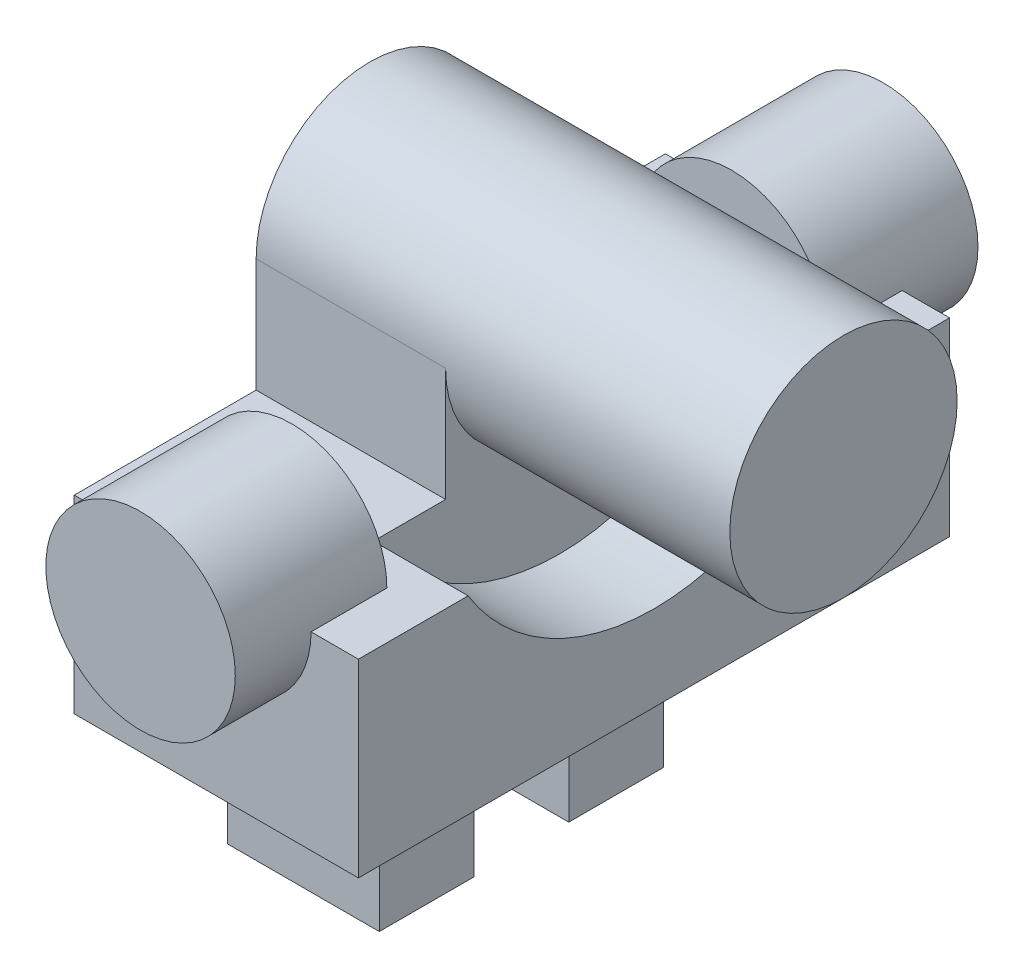
ISO-10303-21;
HEADER;
FILE_DESCRIPTION(('STEP AP214'),'2;1');
FILE_NAME('part.step','',(''),(''),'','','');
FILE_SCHEMA(('AUTOMOTIVE_DESIGN { 1 0 10303 214 1 1 1 1 }'));
ENDSEC;
DATA;
#1=APPLICATION_CONTEXT('core data for automotive mechanical design processes');
#2=APPLICATION_PROTOCOL_DEFINITION('international standard','automotive_design',2000,#1);
#3=PRODUCT_CONTEXT('',#1,'mechanical');
#4=PRODUCT('Part','Part','',(#3));
#5=PRODUCT_RELATED_PRODUCT_CATEGORY('part','',(#4));
#6=PRODUCT_DEFINITION_FORMATION('','',#4);
#7=PRODUCT_DEFINITION_CONTEXT('part definition',#1,'design');
#8=PRODUCT_DEFINITION('design','',#6,#7);
#9=PRODUCT_DEFINITION_SHAPE('','',#8);
#10=(LENGTH_UNIT() NAMED_UNIT(*) SI_UNIT(.MILLI.,.METRE.));
#11=(NAMED_UNIT(*) PLANE_ANGLE_UNIT() SI_UNIT($,.RADIAN.));
#12=(NAMED_UNIT(*) SI_UNIT($,.STERADIAN.) SOLID_ANGLE_UNIT());
#13=UNCERTAINTY_MEASURE_WITH_UNIT(LENGTH_MEASURE(1.E-05),#10,'distance_accuracy_value','');
#14=(GEOMETRIC_REPRESENTATION_CONTEXT(3) GLOBAL_UNCERTAINTY_ASSIGNED_CONTEXT((#13)) GLOBAL_UNIT_ASSIGNED_CONTEXT((#10,
#11,#12)) REPRESENTATION_CONTEXT('',''));
#15=CARTESIAN_POINT('',(0.,0.,0.));
#16=DIRECTION('',(0.,0.,1.));
#17=DIRECTION('',(1.,0.,0.));
#18=AXIS2_PLACEMENT_3D('',#15,#16,#17);
#19=CARTESIAN_POINT('',(2.5,-6.,6.));
#20=DIRECTION('',(0.,1.,0.));
#21=DIRECTION('',(0.,0.,1.));
#22=AXIS2_PLACEMENT_3D('',#19,#20,#21);
#23=PLANE('',#22);
#24=DIRECTION('',(1.,0.,0.));
#25=VECTOR('',#24,1.);
#26=CARTESIAN_POINT('',(2.5,-6.,11.6));
#27=LINE('',#26,#25);
#28=CARTESIAN_POINT('',(-10.,-6.,11.6));
#29=VERTEX_POINT('',#28);
#30=CARTESIAN_POINT('',(0.,-6.,11.6));
#31=VERTEX_POINT('',#30);
#32=EDGE_CURVE('E201',#29,#31,#27,.T.);
#33=ORIENTED_EDGE('',*,*,#32,.T.);
#34=DIRECTION('',(0.,0.,-1.));
#35=VECTOR('',#34,1.);
#36=CARTESIAN_POINT('',(0.,-5.99999999999999,19.6));
#37=LINE('',#36,#35);
#38=CARTESIAN_POINT('',(0.,-6.,15.6));
#39=VERTEX_POINT('',#38);
#40=EDGE_CURVE('E184',#31,#39,#37,.F.);
#41=ORIENTED_EDGE('',*,*,#40,.T.);
#42=DIRECTION('',(-1.,0.,0.));
#43=VECTOR('',#42,1.);
#44=CARTESIAN_POINT('',(2.5,-6.,15.6));
#45=LINE('',#44,#43);
#46=CARTESIAN_POINT('',(2.5,-6.,15.6));
#47=VERTEX_POINT('',#46);
#48=EDGE_CURVE('E219',#47,#39,#45,.T.);
#49=ORIENTED_EDGE('',*,*,#48,.F.);
#50=DIRECTION('',(0.,0.,-1.));
#51=VECTOR('',#50,1.);
#52=CARTESIAN_POINT('',(2.5,-6.,6.));
#53=LINE('',#52,#51);
#54=CARTESIAN_POINT('',(2.5,-6.,9.81070843517429));
#55=VERTEX_POINT('',#54);
#56=EDGE_CURVE('E270',#47,#55,#53,.T.);
#57=ORIENTED_EDGE('',*,*,#56,.T.);
#58=DIRECTION('',(1.,0.,0.));
#59=VECTOR('',#58,1.);
#60=CARTESIAN_POINT('',(-2.5,-6.,9.81070843517429));
#61=LINE('',#60,#59);
#62=CARTESIAN_POINT('',(-2.5,-6.,9.81070843517429));
#63=VERTEX_POINT('',#62);
#64=EDGE_CURVE('E285',#63,#55,#61,.T.);
#65=ORIENTED_EDGE('',*,*,#64,.F.);
#66=DIRECTION('',(0.,0.,-1.));
#67=VECTOR('',#66,1.);
#68=CARTESIAN_POINT('',(-2.5,-6.,6.));
#69=LINE('',#68,#67);
#70=CARTESIAN_POINT('',(-2.5,-6.,6.));
#71=VERTEX_POINT('',#70);
#72=EDGE_CURVE('E204',#63,#71,#69,.T.);
#73=ORIENTED_EDGE('',*,*,#72,.T.);
#74=DIRECTION('',(-1.,0.,0.));
#75=VECTOR('',#74,1.);
#76=CARTESIAN_POINT('',(2.5,-6.,6.));
#77=LINE('',#76,#75);
#78=CARTESIAN_POINT('',(-12.5,-6.,6.));
#79=VERTEX_POINT('',#78);
#80=EDGE_CURVE('E222',#71,#79,#77,.T.);
#81=ORIENTED_EDGE('',*,*,#80,.T.);
#82=DIRECTION('',(0.,0.,-1.));
#83=VECTOR('',#82,1.);
#84=CARTESIAN_POINT('',(-12.5,-6.,6.));
#85=LINE('',#84,#83);
#86=CARTESIAN_POINT('',(-12.5,-6.,15.6));
#87=VERTEX_POINT('',#86);
#88=EDGE_CURVE('E255',#87,#79,#85,.T.);
#89=ORIENTED_EDGE('',*,*,#88,.F.);
#90=CARTESIAN_POINT('',(-10.,-5.99999999999999,15.6));
#91=VERTEX_POINT('',#90);
#92=EDGE_CURVE('E223',#91,#87,#45,.T.);
#93=ORIENTED_EDGE('',*,*,#92,.F.);
#94=DIRECTION('',(0.,0.,-1.));
#95=VECTOR('',#94,1.);
#96=CARTESIAN_POINT('',(-10.,-5.99999999999999,19.6));
#97=LINE('',#96,#95);
#98=EDGE_CURVE('E198',#91,#29,#97,.T.);
#99=ORIENTED_EDGE('',*,*,#98,.T.);
#100=EDGE_LOOP('',(#33,#41,#49,#57,#65,#73,#81,#89,#93,#99));
#101=FACE_BOUND('',#100,.T.);
#102=ADVANCED_FACE('F33',(#101),#23,.T.);
#103=CARTESIAN_POINT('',(2.5,0.,-6.));
#104=DIRECTION('',(0.,0.,-1.));
#105=DIRECTION('',(-1.,0.,0.));
#106=AXIS2_PLACEMENT_3D('',#103,#104,#105);
#107=PLANE('',#106);
#108=DIRECTION('',(-1.,0.,0.));
#109=VECTOR('',#108,1.);
#110=CARTESIAN_POINT('',(2.5,0.,-6.));
#111=LINE('',#110,#109);
#112=CARTESIAN_POINT('',(-2.5,0.,-6.));
#113=VERTEX_POINT('',#112);
#114=CARTESIAN_POINT('',(-12.5,0.,-6.));
#115=VERTEX_POINT('',#114);
#116=EDGE_CURVE('E227',#113,#115,#111,.T.);
#117=ORIENTED_EDGE('',*,*,#116,.F.);
#118=DIRECTION('',(0.,-1.,0.));
#119=VECTOR('',#118,1.);
#120=CARTESIAN_POINT('',(-2.5,0.,-6.));
#121=LINE('',#120,#119);
#122=CARTESIAN_POINT('',(-2.5,-6.,-6.));
#123=VERTEX_POINT('',#122);
#124=EDGE_CURVE('E277',#113,#123,#121,.T.);
#125=ORIENTED_EDGE('',*,*,#124,.T.);
#126=DIRECTION('',(-1.,0.,0.));
#127=VECTOR('',#126,1.);
#128=CARTESIAN_POINT('',(2.5,-6.,-6.));
#129=LINE('',#128,#127);
#130=CARTESIAN_POINT('',(-12.5,-6.,-6.));
#131=VERTEX_POINT('',#130);
#132=EDGE_CURVE('E229',#123,#131,#129,.T.);
#133=ORIENTED_EDGE('',*,*,#132,.T.);
#134=DIRECTION('',(0.,-1.,0.));
#135=VECTOR('',#134,1.);
#136=CARTESIAN_POINT('',(-12.5,0.,-6.));
#137=LINE('',#136,#135);
#138=EDGE_CURVE('E249',#115,#131,#137,.T.);
#139=ORIENTED_EDGE('',*,*,#138,.F.);
#140=EDGE_LOOP('',(#117,#125,#133,#139));
#141=FACE_BOUND('',#140,.T.);
#142=ADVANCED_FACE('F385',(#141),#107,.T.);
#143=CARTESIAN_POINT('',(2.5,0.,6.));
#144=DIRECTION('',(0.,0.,1.));
#145=DIRECTION('',(1.,0.,0.));
#146=AXIS2_PLACEMENT_3D('',#143,#144,#145);
#147=PLANE('',#146);
#148=ORIENTED_EDGE('',*,*,#80,.F.);
#149=DIRECTION('',(0.,1.,0.));
#150=VECTOR('',#149,1.);
#151=CARTESIAN_POINT('',(-2.5,0.,6.));
#152=LINE('',#151,#150);
#153=CARTESIAN_POINT('',(-2.5,0.,6.));
#154=VERTEX_POINT('',#153);
#155=EDGE_CURVE('E280',#71,#154,#152,.T.);
#156=ORIENTED_EDGE('',*,*,#155,.T.);
#157=DIRECTION('',(-1.,0.,0.));
#158=VECTOR('',#157,1.);
#159=CARTESIAN_POINT('',(2.5,0.,6.));
#160=LINE('',#159,#158);
#161=CARTESIAN_POINT('',(-12.5,0.,6.));
#162=VERTEX_POINT('',#161);
#163=EDGE_CURVE('E225',#154,#162,#160,.T.);
#164=ORIENTED_EDGE('',*,*,#163,.T.);
#165=DIRECTION('',(0.,1.,0.));
#166=VECTOR('',#165,1.);
#167=CARTESIAN_POINT('',(-12.5,0.,6.));
#168=LINE('',#167,#166);
#169=EDGE_CURVE('E252',#79,#162,#168,.T.);
#170=ORIENTED_EDGE('',*,*,#169,.F.);
#171=EDGE_LOOP('',(#148,#156,#164,#170));
#172=FACE_BOUND('',#171,.T.);
#173=ADVANCED_FACE('F391',(#172),#147,.T.);
#174=CARTESIAN_POINT('',(12.5,0.,0.));
#175=DIRECTION('',(-1.,0.,0.));
#176=DIRECTION('',(0.,0.,1.));
#177=AXIS2_PLACEMENT_3D('',#174,#175,#176);
#178=CYLINDRICAL_SURFACE('',#177,6.);
#179=CARTESIAN_POINT('',(-2.5,0.,0.));
#180=DIRECTION('',(1.,0.,0.));
#181=DIRECTION('',(0.,0.,-1.));
#182=AXIS2_PLACEMENT_3D('',#179,#180,#181);
#183=CIRCLE('',#182,6.);
#184=EDGE_CURVE('E290',#154,#113,#183,.T.);
#185=ORIENTED_EDGE('',*,*,#184,.T.);
#186=ORIENTED_EDGE('',*,*,#116,.T.);
#187=CARTESIAN_POINT('',(-12.5,0.,0.));
#188=DIRECTION('',(1.,0.,0.));
#189=DIRECTION('',(0.,0.,-1.));
#190=AXIS2_PLACEMENT_3D('',#187,#188,#189);
#191=CIRCLE('',#190,6.);
#192=EDGE_CURVE('E213',#115,#162,#191,.T.);
#193=ORIENTED_EDGE('',*,*,#192,.T.);
#194=ORIENTED_EDGE('',*,*,#163,.F.);
#195=EDGE_LOOP('',(#185,#186,#193,#194));
#196=FACE_BOUND('',#195,.T.);
#197=CARTESIAN_POINT('',(12.5,0.,0.));
#198=DIRECTION('',(1.,0.,0.));
#199=DIRECTION('',(0.,0.,-1.));
#200=AXIS2_PLACEMENT_3D('',#197,#198,#199);
#201=CIRCLE('',#200,6.);
#202=CARTESIAN_POINT('',(12.5,0.,-6.));
#203=VERTEX_POINT('',#202);
#204=EDGE_CURVE('E212',#203,#203,#201,.T.);
#205=ORIENTED_EDGE('',*,*,#204,.F.);
#206=EDGE_LOOP('',(#205));
#207=FACE_BOUND('',#206,.T.);
#208=ADVANCED_FACE('F35',(#196,#207),#178,.T.);
#209=CARTESIAN_POINT('',(12.5,0.,0.));
#210=DIRECTION('',(1.,0.,0.));
#211=DIRECTION('',(0.,0.,-1.));
#212=AXIS2_PLACEMENT_3D('',#209,#210,#211);
#213=PLANE('',#212);
#214=ORIENTED_EDGE('',*,*,#204,.T.);
#215=EDGE_LOOP('',(#214));
#216=FACE_BOUND('',#215,.T.);
#217=ADVANCED_FACE('F402',(#216),#213,.T.);
#218=CARTESIAN_POINT('',(-12.5,0.,0.));
#219=DIRECTION('',(1.,0.,0.));
#220=DIRECTION('',(0.,0.,-1.));
#221=AXIS2_PLACEMENT_3D('',#218,#219,#220);
#222=PLANE('',#221);
#223=ORIENTED_EDGE('',*,*,#192,.F.);
#224=ORIENTED_EDGE('',*,*,#138,.T.);
#225=DIRECTION('',(0.,0.,-1.));
#226=VECTOR('',#225,1.);
#227=CARTESIAN_POINT('',(-12.5,-6.,-15.6));
#228=LINE('',#227,#226);
#229=CARTESIAN_POINT('',(-12.5,-6.,-15.6));
#230=VERTEX_POINT('',#229);
#231=EDGE_CURVE('E246',#131,#230,#228,.T.);
#232=ORIENTED_EDGE('',*,*,#231,.T.);
#233=DIRECTION('',(0.,-1.,0.));
#234=VECTOR('',#233,1.);
#235=CARTESIAN_POINT('',(-12.5,-6.,-15.6));
#236=LINE('',#235,#234);
#237=CARTESIAN_POINT('',(-12.5,-16.,-15.6));
#238=VERTEX_POINT('',#237);
#239=EDGE_CURVE('E243',#230,#238,#236,.T.);
#240=ORIENTED_EDGE('',*,*,#239,.T.);
#241=DIRECTION('',(0.,0.,1.));
#242=VECTOR('',#241,1.);
#243=CARTESIAN_POINT('',(-12.5,-16.,-15.6));
#244=LINE('',#243,#242);
#245=CARTESIAN_POINT('',(-12.5,-16.,-7.49999999999999));
#246=VERTEX_POINT('',#245);
#247=EDGE_CURVE('E237',#238,#246,#244,.T.);
#248=ORIENTED_EDGE('',*,*,#247,.T.);
#249=DIRECTION('',(0.,-1.,0.));
#250=VECTOR('',#249,1.);
#251=CARTESIAN_POINT('',(-12.5,-16.,-7.49999999999999));
#252=LINE('',#251,#250);
#253=CARTESIAN_POINT('',(-12.5,-26.,-7.49999999999998));
#254=VERTEX_POINT('',#253);
#255=EDGE_CURVE('E342',#246,#254,#252,.T.);
#256=ORIENTED_EDGE('',*,*,#255,.T.);
#257=DIRECTION('',(0.,0.,1.));
#258=VECTOR('',#257,1.);
#259=CARTESIAN_POINT('',(-12.5,-26.,-7.49999999999998));
#260=LINE('',#259,#258);
#261=CARTESIAN_POINT('',(-12.5,-26.,-2.49999999999998));
#262=VERTEX_POINT('',#261);
#263=EDGE_CURVE('E339',#254,#262,#260,.T.);
#264=ORIENTED_EDGE('',*,*,#263,.T.);
#265=DIRECTION('',(0.,1.,0.));
#266=VECTOR('',#265,1.);
#267=CARTESIAN_POINT('',(-12.5,-16.,-2.49999999999999));
#268=LINE('',#267,#266);
#269=CARTESIAN_POINT('',(-12.5,-16.,-2.49999999999998));
#270=VERTEX_POINT('',#269);
#271=EDGE_CURVE('E336',#262,#270,#268,.T.);
#272=ORIENTED_EDGE('',*,*,#271,.T.);
#273=CARTESIAN_POINT('',(-12.5,-16.,2.49999999999999));
#274=VERTEX_POINT('',#273);
#275=EDGE_CURVE('E241',#270,#274,#244,.T.);
#276=ORIENTED_EDGE('',*,*,#275,.T.);
#277=DIRECTION('',(0.,-1.,0.));
#278=VECTOR('',#277,1.);
#279=CARTESIAN_POINT('',(-12.5,-16.,2.49999999999999));
#280=LINE('',#279,#278);
#281=CARTESIAN_POINT('',(-12.5,-26.,2.5));
#282=VERTEX_POINT('',#281);
#283=EDGE_CURVE('E309',#274,#282,#280,.T.);
#284=ORIENTED_EDGE('',*,*,#283,.T.);
#285=DIRECTION('',(0.,0.,1.));
#286=VECTOR('',#285,1.);
#287=CARTESIAN_POINT('',(-12.5,-26.,7.5));
#288=LINE('',#287,#286);
#289=CARTESIAN_POINT('',(-12.5,-26.,7.5));
#290=VERTEX_POINT('',#289);
#291=EDGE_CURVE('E305',#282,#290,#288,.T.);
#292=ORIENTED_EDGE('',*,*,#291,.T.);
#293=DIRECTION('',(0.,1.,0.));
#294=VECTOR('',#293,1.);
#295=CARTESIAN_POINT('',(-12.5,-16.,7.49999999999999));
#296=LINE('',#295,#294);
#297=CARTESIAN_POINT('',(-12.5,-16.,7.49999999999999));
#298=VERTEX_POINT('',#297);
#299=EDGE_CURVE('E312',#290,#298,#296,.T.);
#300=ORIENTED_EDGE('',*,*,#299,.T.);
#301=CARTESIAN_POINT('',(-12.5,-16.,15.6));
#302=VERTEX_POINT('',#301);
#303=EDGE_CURVE('E242',#298,#302,#244,.T.);
#304=ORIENTED_EDGE('',*,*,#303,.T.);
#305=DIRECTION('',(0.,1.,0.));
#306=VECTOR('',#305,1.);
#307=CARTESIAN_POINT('',(-12.5,-6.,15.6));
#308=LINE('',#307,#306);
#309=EDGE_CURVE('E258',#302,#87,#308,.T.);
#310=ORIENTED_EDGE('',*,*,#309,.T.);
#311=ORIENTED_EDGE('',*,*,#88,.T.);
#312=ORIENTED_EDGE('',*,*,#169,.T.);
#313=EDGE_LOOP('',(#223,#224,#232,#240,#248,#256,#264,#272,#276,#284,#292,#300,#304,#310,#311,#312));
#314=FACE_BOUND('',#313,.T.);
#315=ADVANCED_FACE('F400',(#314),#222,.F.);
#316=CARTESIAN_POINT('',(2.5,-6.,15.6));
#317=DIRECTION('',(0.,0.,1.));
#318=DIRECTION('',(0.,-1.,0.));
#319=AXIS2_PLACEMENT_3D('',#316,#317,#318);
#320=PLANE('',#319);
#321=ORIENTED_EDGE('',*,*,#48,.T.);
#322=CARTESIAN_POINT('',(-5.,-6.,15.6));
#323=DIRECTION('',(0.,0.,1.));
#324=DIRECTION('',(0.,-1.,0.));
#325=AXIS2_PLACEMENT_3D('',#322,#323,#324);
#326=CIRCLE('',#325,5.);
#327=EDGE_CURVE('E361',#39,#91,#326,.F.);
#328=ORIENTED_EDGE('',*,*,#327,.T.);
#329=ORIENTED_EDGE('',*,*,#92,.T.);
#330=ORIENTED_EDGE('',*,*,#309,.F.);
#331=DIRECTION('',(-1.,0.,0.));
#332=VECTOR('',#331,1.);
#333=CARTESIAN_POINT('',(2.5,-16.,15.6));
#334=LINE('',#333,#332);
#335=CARTESIAN_POINT('',(2.5,-16.,15.6));
#336=VERTEX_POINT('',#335);
#337=EDGE_CURVE('E216',#336,#302,#334,.T.);
#338=ORIENTED_EDGE('',*,*,#337,.F.);
#339=DIRECTION('',(0.,1.,0.));
#340=VECTOR('',#339,1.);
#341=CARTESIAN_POINT('',(2.5,-6.,15.6));
#342=LINE('',#341,#340);
#343=EDGE_CURVE('E240',#336,#47,#342,.T.);
#344=ORIENTED_EDGE('',*,*,#343,.T.);
#345=EDGE_LOOP('',(#321,#328,#329,#330,#338,#344));
#346=FACE_BOUND('',#345,.T.);
#347=ADVANCED_FACE('F396',(#346),#320,.T.);
#348=CARTESIAN_POINT('',(2.5,-16.,-15.6));
#349=DIRECTION('',(0.,-1.,0.));
#350=DIRECTION('',(0.,0.,-1.));
#351=AXIS2_PLACEMENT_3D('',#348,#349,#350);
#352=PLANE('',#351);
#353=DIRECTION('',(-1.,0.,0.));
#354=VECTOR('',#353,1.);
#355=CARTESIAN_POINT('',(-4.5,-16.,-7.49999999999999));
#356=LINE('',#355,#354);
#357=CARTESIAN_POINT('',(-4.5,-16.,-7.49999999999999));
#358=VERTEX_POINT('',#357);
#359=EDGE_CURVE('E315',#358,#246,#356,.T.);
#360=ORIENTED_EDGE('',*,*,#359,.T.);
#361=ORIENTED_EDGE('',*,*,#247,.F.);
#362=DIRECTION('',(-1.,0.,0.));
#363=VECTOR('',#362,1.);
#364=CARTESIAN_POINT('',(2.5,-16.,-15.6));
#365=LINE('',#364,#363);
#366=CARTESIAN_POINT('',(2.5,-16.,-15.6));
#367=VERTEX_POINT('',#366);
#368=EDGE_CURVE('E233',#367,#238,#365,.T.);
#369=ORIENTED_EDGE('',*,*,#368,.F.);
#370=DIRECTION('',(0.,0.,1.));
#371=VECTOR('',#370,1.);
#372=CARTESIAN_POINT('',(2.5,-16.,-15.6));
#373=LINE('',#372,#371);
#374=EDGE_CURVE('E262',#367,#336,#373,.T.);
#375=ORIENTED_EDGE('',*,*,#374,.T.);
#376=ORIENTED_EDGE('',*,*,#337,.T.);
#377=ORIENTED_EDGE('',*,*,#303,.F.);
#378=DIRECTION('',(-1.,0.,0.));
#379=VECTOR('',#378,1.);
#380=CARTESIAN_POINT('',(-4.5,-16.,7.49999999999999));
#381=LINE('',#380,#379);
#382=CARTESIAN_POINT('',(-4.5,-16.,7.49999999999999));
#383=VERTEX_POINT('',#382);
#384=EDGE_CURVE('E296',#383,#298,#381,.T.);
#385=ORIENTED_EDGE('',*,*,#384,.F.);
#386=DIRECTION('',(0.,0.,-1.));
#387=VECTOR('',#386,1.);
#388=CARTESIAN_POINT('',(-4.5,-16.,7.49999999999999));
#389=LINE('',#388,#387);
#390=CARTESIAN_POINT('',(-4.5,-16.,2.49999999999999));
#391=VERTEX_POINT('',#390);
#392=EDGE_CURVE('E321',#383,#391,#389,.T.);
#393=ORIENTED_EDGE('',*,*,#392,.T.);
#394=DIRECTION('',(-1.,0.,0.));
#395=VECTOR('',#394,1.);
#396=CARTESIAN_POINT('',(-4.5,-16.,2.49999999999999));
#397=LINE('',#396,#395);
#398=EDGE_CURVE('E298',#391,#274,#397,.T.);
#399=ORIENTED_EDGE('',*,*,#398,.T.);
#400=ORIENTED_EDGE('',*,*,#275,.F.);
#401=DIRECTION('',(-1.,0.,0.));
#402=VECTOR('',#401,1.);
#403=CARTESIAN_POINT('',(-4.5,-16.,-2.49999999999999));
#404=LINE('',#403,#402);
#405=CARTESIAN_POINT('',(-4.5,-16.,-2.49999999999999));
#406=VERTEX_POINT('',#405);
#407=EDGE_CURVE('E331',#406,#270,#404,.T.);
#408=ORIENTED_EDGE('',*,*,#407,.F.);
#409=DIRECTION('',(0.,0.,-1.));
#410=VECTOR('',#409,1.);
#411=CARTESIAN_POINT('',(-4.5,-16.,-7.49999999999999));
#412=LINE('',#411,#410);
#413=EDGE_CURVE('E329',#406,#358,#412,.T.);
#414=ORIENTED_EDGE('',*,*,#413,.T.);
#415=EDGE_LOOP('',(#360,#361,#369,#375,#376,#377,#385,#393,#399,#400,#408,#414));
#416=FACE_BOUND('',#415,.T.);
#417=ADVANCED_FACE('F399',(#416),#352,.T.);
#418=CARTESIAN_POINT('',(2.5,-6.,-15.6));
#419=DIRECTION('',(0.,0.,-1.));
#420=DIRECTION('',(-1.,0.,0.));
#421=AXIS2_PLACEMENT_3D('',#418,#419,#420);
#422=PLANE('',#421);
#423=CARTESIAN_POINT('',(-5.,-6.,-15.6));
#424=DIRECTION('',(0.,0.,-1.));
#425=DIRECTION('',(-1.,0.,0.));
#426=AXIS2_PLACEMENT_3D('',#423,#424,#425);
#427=CIRCLE('',#426,5.);
#428=CARTESIAN_POINT('',(0.,-6.,-15.6));
#429=VERTEX_POINT('',#428);
#430=CARTESIAN_POINT('',(-10.,-6.,-15.6));
#431=VERTEX_POINT('',#430);
#432=EDGE_CURVE('E366',#429,#431,#427,.T.);
#433=ORIENTED_EDGE('',*,*,#432,.F.);
#434=DIRECTION('',(-1.,0.,0.));
#435=VECTOR('',#434,1.);
#436=CARTESIAN_POINT('',(2.5,-6.,-15.6));
#437=LINE('',#436,#435);
#438=CARTESIAN_POINT('',(2.5,-6.,-15.6));
#439=VERTEX_POINT('',#438);
#440=EDGE_CURVE('E194',#439,#429,#437,.T.);
#441=ORIENTED_EDGE('',*,*,#440,.F.);
#442=DIRECTION('',(0.,-1.,0.));
#443=VECTOR('',#442,1.);
#444=CARTESIAN_POINT('',(2.5,-6.,-15.6));
#445=LINE('',#444,#443);
#446=EDGE_CURVE('E265',#439,#367,#445,.T.);
#447=ORIENTED_EDGE('',*,*,#446,.T.);
#448=ORIENTED_EDGE('',*,*,#368,.T.);
#449=ORIENTED_EDGE('',*,*,#239,.F.);
#450=EDGE_CURVE('E231',#431,#230,#437,.T.);
#451=ORIENTED_EDGE('',*,*,#450,.F.);
#452=EDGE_LOOP('',(#433,#441,#447,#448,#449,#451));
#453=FACE_BOUND('',#452,.T.);
#454=ADVANCED_FACE('F462',(#453),#422,.T.);
#455=CARTESIAN_POINT('',(2.5,-6.,-15.6));
#456=DIRECTION('',(0.,1.,0.));
#457=DIRECTION('',(0.,0.,1.));
#458=AXIS2_PLACEMENT_3D('',#455,#456,#457);
#459=PLANE('',#458);
#460=DIRECTION('',(0.,0.,1.));
#461=VECTOR('',#460,1.);
#462=CARTESIAN_POINT('',(-10.,-6.,-19.6));
#463=LINE('',#462,#461);
#464=CARTESIAN_POINT('',(-10.,-6.,-11.6));
#465=VERTEX_POINT('',#464);
#466=EDGE_CURVE('E12',#431,#465,#463,.T.);
#467=ORIENTED_EDGE('',*,*,#466,.F.);
#468=ORIENTED_EDGE('',*,*,#450,.T.);
#469=ORIENTED_EDGE('',*,*,#231,.F.);
#470=ORIENTED_EDGE('',*,*,#132,.F.);
#471=DIRECTION('',(0.,0.,-1.));
#472=VECTOR('',#471,1.);
#473=CARTESIAN_POINT('',(-2.5,-6.,-15.6));
#474=LINE('',#473,#472);
#475=CARTESIAN_POINT('',(-2.5,-6.,-9.81070843517429));
#476=VERTEX_POINT('',#475);
#477=EDGE_CURVE('E261',#123,#476,#474,.T.);
#478=ORIENTED_EDGE('',*,*,#477,.T.);
#479=DIRECTION('',(1.,0.,0.));
#480=VECTOR('',#479,1.);
#481=CARTESIAN_POINT('',(-2.5,-6.,-9.81070843517429));
#482=LINE('',#481,#480);
#483=CARTESIAN_POINT('',(2.5,-6.,-9.81070843517429));
#484=VERTEX_POINT('',#483);
#485=EDGE_CURVE('E283',#484,#476,#482,.F.);
#486=ORIENTED_EDGE('',*,*,#485,.F.);
#487=DIRECTION('',(0.,0.,-1.));
#488=VECTOR('',#487,1.);
#489=CARTESIAN_POINT('',(2.5,-6.,-15.6));
#490=LINE('',#489,#488);
#491=EDGE_CURVE('E268',#484,#439,#490,.T.);
#492=ORIENTED_EDGE('',*,*,#491,.T.);
#493=ORIENTED_EDGE('',*,*,#440,.T.);
#494=DIRECTION('',(0.,0.,1.));
#495=VECTOR('',#494,1.);
#496=CARTESIAN_POINT('',(0.,-6.,-19.6));
#497=LINE('',#496,#495);
#498=CARTESIAN_POINT('',(0.,-6.,-11.6));
#499=VERTEX_POINT('',#498);
#500=EDGE_CURVE('E41',#499,#429,#497,.F.);
#501=ORIENTED_EDGE('',*,*,#500,.F.);
#502=DIRECTION('',(-1.,0.,0.));
#503=VECTOR('',#502,1.);
#504=CARTESIAN_POINT('',(2.5,-6.,-11.6));
#505=LINE('',#504,#503);
#506=EDGE_CURVE('E179',#499,#465,#505,.T.);
#507=ORIENTED_EDGE('',*,*,#506,.T.);
#508=EDGE_LOOP('',(#467,#468,#469,#470,#478,#486,#492,#493,#501,#507));
#509=FACE_BOUND('',#508,.T.);
#510=ADVANCED_FACE('F192',(#509),#459,.T.);
#511=CARTESIAN_POINT('',(2.5,0.,0.));
#512=DIRECTION('',(-1.,0.,0.));
#513=DIRECTION('',(0.,0.,1.));
#514=AXIS2_PLACEMENT_3D('',#511,#512,#513);
#515=PLANE('',#514);
#516=ORIENTED_EDGE('',*,*,#491,.F.);
#517=CARTESIAN_POINT('',(2.5,0.,0.));
#518=DIRECTION('',(1.,0.,0.));
#519=DIRECTION('',(0.,0.,-1.));
#520=AXIS2_PLACEMENT_3D('',#517,#518,#519);
#521=CIRCLE('',#520,11.5);
#522=EDGE_CURVE('E288',#55,#484,#521,.T.);
#523=ORIENTED_EDGE('',*,*,#522,.F.);
#524=ORIENTED_EDGE('',*,*,#56,.F.);
#525=ORIENTED_EDGE('',*,*,#343,.F.);
#526=ORIENTED_EDGE('',*,*,#374,.F.);
#527=ORIENTED_EDGE('',*,*,#446,.F.);
#528=EDGE_LOOP('',(#516,#523,#524,#525,#526,#527));
#529=FACE_BOUND('',#528,.T.);
#530=ADVANCED_FACE('F460',(#529),#515,.F.);
#531=CARTESIAN_POINT('',(-2.5,0.,0.));
#532=DIRECTION('',(1.,0.,0.));
#533=DIRECTION('',(0.,0.,-1.));
#534=AXIS2_PLACEMENT_3D('',#531,#532,#533);
#535=CYLINDRICAL_SURFACE('',#534,11.5);
#536=ORIENTED_EDGE('',*,*,#485,.T.);
#537=CARTESIAN_POINT('',(-2.5,0.,0.));
#538=DIRECTION('',(1.,0.,0.));
#539=DIRECTION('',(0.,0.,-1.));
#540=AXIS2_PLACEMENT_3D('',#537,#538,#539);
#541=CIRCLE('',#540,11.5);
#542=EDGE_CURVE('E287',#63,#476,#541,.T.);
#543=ORIENTED_EDGE('',*,*,#542,.F.);
#544=ORIENTED_EDGE('',*,*,#64,.T.);
#545=ORIENTED_EDGE('',*,*,#522,.T.);
#546=EDGE_LOOP('',(#536,#543,#544,#545));
#547=FACE_BOUND('',#546,.T.);
#548=ADVANCED_FACE('F474',(#547),#535,.F.);
#549=CARTESIAN_POINT('',(-2.5,0.,0.));
#550=DIRECTION('',(1.,0.,0.));
#551=DIRECTION('',(0.,0.,-1.));
#552=AXIS2_PLACEMENT_3D('',#549,#550,#551);
#553=PLANE('',#552);
#554=ORIENTED_EDGE('',*,*,#124,.F.);
#555=ORIENTED_EDGE('',*,*,#184,.F.);
#556=ORIENTED_EDGE('',*,*,#155,.F.);
#557=ORIENTED_EDGE('',*,*,#72,.F.);
#558=ORIENTED_EDGE('',*,*,#542,.T.);
#559=ORIENTED_EDGE('',*,*,#477,.F.);
#560=EDGE_LOOP('',(#554,#555,#556,#557,#558,#559));
#561=FACE_BOUND('',#560,.T.);
#562=ADVANCED_FACE('F452',(#561),#553,.T.);
#563=CARTESIAN_POINT('',(-4.5,-16.,7.49999999999999));
#564=DIRECTION('',(0.,0.,1.));
#565=DIRECTION('',(0.,-1.,0.));
#566=AXIS2_PLACEMENT_3D('',#563,#564,#565);
#567=PLANE('',#566);
#568=CARTESIAN_POINT('',(-8.5,-22.3,7.49999999999998));
#569=DIRECTION('',(0.,0.,1.));
#570=DIRECTION('',(1.,0.,0.));
#571=AXIS2_PLACEMENT_3D('',#568,#569,#570);
#572=CIRCLE('',#571,1.7);
#573=CARTESIAN_POINT('',(-6.8,-22.3,7.49999999999998));
#574=VERTEX_POINT('',#573);
#575=EDGE_CURVE('E358',#574,#574,#572,.T.);
#576=ORIENTED_EDGE('',*,*,#575,.F.);
#577=EDGE_LOOP('',(#576));
#578=FACE_BOUND('',#577,.T.);
#579=ORIENTED_EDGE('',*,*,#299,.F.);
#580=DIRECTION('',(-1.,0.,0.));
#581=VECTOR('',#580,1.);
#582=CARTESIAN_POINT('',(-4.5,-26.,7.5));
#583=LINE('',#582,#581);
#584=CARTESIAN_POINT('',(-4.5,-26.,7.5));
#585=VERTEX_POINT('',#584);
#586=EDGE_CURVE('E295',#585,#290,#583,.T.);
#587=ORIENTED_EDGE('',*,*,#586,.F.);
#588=DIRECTION('',(0.,1.,0.));
#589=VECTOR('',#588,1.);
#590=CARTESIAN_POINT('',(-4.5,-16.,7.49999999999999));
#591=LINE('',#590,#589);
#592=EDGE_CURVE('E308',#585,#383,#591,.T.);
#593=ORIENTED_EDGE('',*,*,#592,.T.);
#594=ORIENTED_EDGE('',*,*,#384,.T.);
#595=EDGE_LOOP('',(#579,#587,#593,#594));
#596=FACE_BOUND('',#595,.T.);
#597=ADVANCED_FACE('F479',(#578,#596),#567,.T.);
#598=CARTESIAN_POINT('',(-4.5,-26.,7.5));
#599=DIRECTION('',(0.,-1.,0.));
#600=DIRECTION('',(0.,0.,-1.));
#601=AXIS2_PLACEMENT_3D('',#598,#599,#600);
#602=PLANE('',#601);
#603=ORIENTED_EDGE('',*,*,#291,.F.);
#604=DIRECTION('',(-1.,0.,0.));
#605=VECTOR('',#604,1.);
#606=CARTESIAN_POINT('',(-4.5,-26.,2.5));
#607=LINE('',#606,#605);
#608=CARTESIAN_POINT('',(-4.5,-26.,2.5));
#609=VERTEX_POINT('',#608);
#610=EDGE_CURVE('E302',#609,#282,#607,.T.);
#611=ORIENTED_EDGE('',*,*,#610,.F.);
#612=DIRECTION('',(0.,0.,1.));
#613=VECTOR('',#612,1.);
#614=CARTESIAN_POINT('',(-4.5,-26.,7.5));
#615=LINE('',#614,#613);
#616=EDGE_CURVE('E299',#609,#585,#615,.T.);
#617=ORIENTED_EDGE('',*,*,#616,.T.);
#618=ORIENTED_EDGE('',*,*,#586,.T.);
#619=EDGE_LOOP('',(#603,#611,#617,#618));
#620=FACE_BOUND('',#619,.T.);
#621=ADVANCED_FACE('F482',(#620),#602,.T.);
#622=CARTESIAN_POINT('',(-4.5,-16.,2.49999999999999));
#623=DIRECTION('',(0.,0.,-1.));
#624=DIRECTION('',(0.,1.,0.));
#625=AXIS2_PLACEMENT_3D('',#622,#623,#624);
#626=PLANE('',#625);
#627=CARTESIAN_POINT('',(-8.5,-22.3,2.5));
#628=DIRECTION('',(0.,0.,-1.));
#629=DIRECTION('',(0.,1.,0.));
#630=AXIS2_PLACEMENT_3D('',#627,#628,#629);
#631=CIRCLE('',#630,1.7);
#632=CARTESIAN_POINT('',(-8.5,-20.6,2.49999999999999));
#633=VERTEX_POINT('',#632);
#634=EDGE_CURVE('E208',#633,#633,#631,.T.);
#635=ORIENTED_EDGE('',*,*,#634,.F.);
#636=EDGE_LOOP('',(#635));
#637=FACE_BOUND('',#636,.T.);
#638=ORIENTED_EDGE('',*,*,#283,.F.);
#639=ORIENTED_EDGE('',*,*,#398,.F.);
#640=DIRECTION('',(0.,-1.,0.));
#641=VECTOR('',#640,1.);
#642=CARTESIAN_POINT('',(-4.5,-16.,2.49999999999999));
#643=LINE('',#642,#641);
#644=EDGE_CURVE('E318',#391,#609,#643,.T.);
#645=ORIENTED_EDGE('',*,*,#644,.T.);
#646=ORIENTED_EDGE('',*,*,#610,.T.);
#647=EDGE_LOOP('',(#638,#639,#645,#646));
#648=FACE_BOUND('',#647,.T.);
#649=ADVANCED_FACE('F484',(#637,#648),#626,.T.);
#650=CARTESIAN_POINT('',(-4.5,0.,0.));
#651=DIRECTION('',(1.,0.,0.));
#652=DIRECTION('',(0.,0.,-1.));
#653=AXIS2_PLACEMENT_3D('',#650,#651,#652);
#654=PLANE('',#653);
#655=ORIENTED_EDGE('',*,*,#592,.F.);
#656=ORIENTED_EDGE('',*,*,#616,.F.);
#657=ORIENTED_EDGE('',*,*,#644,.F.);
#658=ORIENTED_EDGE('',*,*,#392,.F.);
#659=EDGE_LOOP('',(#655,#656,#657,#658));
#660=FACE_BOUND('',#659,.T.);
#661=ADVANCED_FACE('F487',(#660),#654,.T.);
#662=CARTESIAN_POINT('',(-4.5,-16.,-7.49999999999999));
#663=DIRECTION('',(0.,0.,-1.));
#664=DIRECTION('',(0.,1.,0.));
#665=AXIS2_PLACEMENT_3D('',#662,#663,#664);
#666=PLANE('',#665);
#667=CARTESIAN_POINT('',(-8.5,-22.3,-7.49999999999998));
#668=DIRECTION('',(0.,0.,-1.));
#669=DIRECTION('',(0.,1.,0.));
#670=AXIS2_PLACEMENT_3D('',#667,#668,#669);
#671=CIRCLE('',#670,1.7);
#672=CARTESIAN_POINT('',(-8.5,-20.6,-7.49999999999999));
#673=VERTEX_POINT('',#672);
#674=EDGE_CURVE('E209',#673,#673,#671,.F.);
#675=ORIENTED_EDGE('',*,*,#674,.T.);
#676=EDGE_LOOP('',(#675));
#677=FACE_BOUND('',#676,.T.);
#678=ORIENTED_EDGE('',*,*,#255,.F.);
#679=ORIENTED_EDGE('',*,*,#359,.F.);
#680=DIRECTION('',(0.,-1.,0.));
#681=VECTOR('',#680,1.);
#682=CARTESIAN_POINT('',(-4.5,-16.,-7.49999999999999));
#683=LINE('',#682,#681);
#684=CARTESIAN_POINT('',(-4.5,-26.,-7.49999999999998));
#685=VERTEX_POINT('',#684);
#686=EDGE_CURVE('E338',#358,#685,#683,.T.);
#687=ORIENTED_EDGE('',*,*,#686,.T.);
#688=DIRECTION('',(-1.,0.,0.));
#689=VECTOR('',#688,1.);
#690=CARTESIAN_POINT('',(-4.5,-26.,-7.49999999999998));
#691=LINE('',#690,#689);
#692=EDGE_CURVE('E326',#685,#254,#691,.T.);
#693=ORIENTED_EDGE('',*,*,#692,.T.);
#694=EDGE_LOOP('',(#678,#679,#687,#693));
#695=FACE_BOUND('',#694,.T.);
#696=ADVANCED_FACE('F426',(#677,#695),#666,.T.);
#697=CARTESIAN_POINT('',(-4.5,-16.,-2.49999999999999));
#698=DIRECTION('',(0.,0.,1.));
#699=DIRECTION('',(0.,-1.,0.));
#700=AXIS2_PLACEMENT_3D('',#697,#698,#699);
#701=PLANE('',#700);
#702=CARTESIAN_POINT('',(-8.5,-22.3,-2.49999999999998));
#703=DIRECTION('',(0.,0.,1.));
#704=DIRECTION('',(0.,-1.,0.));
#705=AXIS2_PLACEMENT_3D('',#702,#703,#704);
#706=CIRCLE('',#705,1.7);
#707=CARTESIAN_POINT('',(-8.5,-24.,-2.49999999999998));
#708=VERTEX_POINT('',#707);
#709=EDGE_CURVE('E205',#708,#708,#706,.T.);
#710=ORIENTED_EDGE('',*,*,#709,.F.);
#711=EDGE_LOOP('',(#710));
#712=FACE_BOUND('',#711,.T.);
#713=ORIENTED_EDGE('',*,*,#271,.F.);
#714=DIRECTION('',(-1.,0.,0.));
#715=VECTOR('',#714,1.);
#716=CARTESIAN_POINT('',(-4.5,-26.,-2.49999999999998));
#717=LINE('',#716,#715);
#718=CARTESIAN_POINT('',(-4.5,-26.,-2.49999999999998));
#719=VERTEX_POINT('',#718);
#720=EDGE_CURVE('E328',#719,#262,#717,.T.);
#721=ORIENTED_EDGE('',*,*,#720,.F.);
#722=DIRECTION('',(0.,1.,0.));
#723=VECTOR('',#722,1.);
#724=CARTESIAN_POINT('',(-4.5,-16.,-2.49999999999999));
#725=LINE('',#724,#723);
#726=EDGE_CURVE('E347',#719,#406,#725,.T.);
#727=ORIENTED_EDGE('',*,*,#726,.T.);
#728=ORIENTED_EDGE('',*,*,#407,.T.);
#729=EDGE_LOOP('',(#713,#721,#727,#728));
#730=FACE_BOUND('',#729,.T.);
#731=ADVANCED_FACE('F438',(#712,#730),#701,.T.);
#732=CARTESIAN_POINT('',(-4.5,-26.,-7.49999999999998));
#733=DIRECTION('',(0.,-1.,0.));
#734=DIRECTION('',(0.,0.,-1.));
#735=AXIS2_PLACEMENT_3D('',#732,#733,#734);
#736=PLANE('',#735);
#737=ORIENTED_EDGE('',*,*,#263,.F.);
#738=ORIENTED_EDGE('',*,*,#692,.F.);
#739=DIRECTION('',(0.,0.,1.));
#740=VECTOR('',#739,1.);
#741=CARTESIAN_POINT('',(-4.5,-26.,-7.49999999999998));
#742=LINE('',#741,#740);
#743=EDGE_CURVE('E349',#685,#719,#742,.T.);
#744=ORIENTED_EDGE('',*,*,#743,.T.);
#745=ORIENTED_EDGE('',*,*,#720,.T.);
#746=EDGE_LOOP('',(#737,#738,#744,#745));
#747=FACE_BOUND('',#746,.T.);
#748=ADVANCED_FACE('F433',(#747),#736,.T.);
#749=CARTESIAN_POINT('',(-4.5,0.,0.));
#750=DIRECTION('',(-1.,0.,0.));
#751=DIRECTION('',(0.,0.,1.));
#752=AXIS2_PLACEMENT_3D('',#749,#750,#751);
#753=PLANE('',#752);
#754=ORIENTED_EDGE('',*,*,#686,.F.);
#755=ORIENTED_EDGE('',*,*,#413,.F.);
#756=ORIENTED_EDGE('',*,*,#726,.F.);
#757=ORIENTED_EDGE('',*,*,#743,.F.);
#758=EDGE_LOOP('',(#754,#755,#756,#757));
#759=FACE_BOUND('',#758,.T.);
#760=ADVANCED_FACE('F429',(#759),#753,.F.);
#761=CARTESIAN_POINT('',(-8.5,-22.3,-12.3083261120685));
#762=DIRECTION('',(0.,0.,1.));
#763=DIRECTION('',(1.,0.,0.));
#764=AXIS2_PLACEMENT_3D('',#761,#762,#763);
#765=CYLINDRICAL_SURFACE('',#764,1.7);
#766=ORIENTED_EDGE('',*,*,#709,.T.);
#767=EDGE_LOOP('',(#766));
#768=FACE_BOUND('',#767,.T.);
#769=ORIENTED_EDGE('',*,*,#674,.F.);
#770=EDGE_LOOP('',(#769));
#771=FACE_BOUND('',#770,.T.);
#772=ADVANCED_FACE('F505',(#768,#771),#765,.F.);
#773=ORIENTED_EDGE('',*,*,#634,.T.);
#774=EDGE_LOOP('',(#773));
#775=FACE_BOUND('',#774,.T.);
#776=ORIENTED_EDGE('',*,*,#575,.T.);
#777=EDGE_LOOP('',(#776));
#778=FACE_BOUND('',#777,.T.);
#779=ADVANCED_FACE('F508',(#775,#778),#765,.F.);
#780=CARTESIAN_POINT('',(-5.,-6.,19.6));
#781=DIRECTION('',(0.,0.,-1.));
#782=DIRECTION('',(-1.,0.,0.));
#783=AXIS2_PLACEMENT_3D('',#780,#781,#782);
#784=CYLINDRICAL_SURFACE('',#783,5.);
#785=ORIENTED_EDGE('',*,*,#40,.F.);
#786=CARTESIAN_POINT('',(-5.,-6.,11.6));
#787=DIRECTION('',(0.,0.,1.));
#788=DIRECTION('',(1.,0.,0.));
#789=AXIS2_PLACEMENT_3D('',#786,#787,#788);
#790=CIRCLE('',#789,5.);
#791=EDGE_CURVE('E53',#31,#29,#790,.T.);
#792=ORIENTED_EDGE('',*,*,#791,.T.);
#793=ORIENTED_EDGE('',*,*,#98,.F.);
#794=ORIENTED_EDGE('',*,*,#327,.F.);
#795=EDGE_LOOP('',(#785,#792,#793,#794));
#796=FACE_BOUND('',#795,.T.);
#797=CARTESIAN_POINT('',(-5.,-6.,19.6));
#798=DIRECTION('',(0.,0.,1.));
#799=DIRECTION('',(1.,0.,0.));
#800=AXIS2_PLACEMENT_3D('',#797,#798,#799);
#801=CIRCLE('',#800,5.);
#802=CARTESIAN_POINT('',(0.,-6.,19.6));
#803=VERTEX_POINT('',#802);
#804=EDGE_CURVE('E364',#803,#803,#801,.T.);
#805=ORIENTED_EDGE('',*,*,#804,.F.);
#806=EDGE_LOOP('',(#805));
#807=FACE_BOUND('',#806,.T.);
#808=ADVANCED_FACE('F510',(#796,#807),#784,.T.);
#809=CARTESIAN_POINT('',(-5.,-6.,19.6));
#810=DIRECTION('',(0.,0.,1.));
#811=DIRECTION('',(1.,0.,0.));
#812=AXIS2_PLACEMENT_3D('',#809,#810,#811);
#813=PLANE('',#812);
#814=ORIENTED_EDGE('',*,*,#804,.T.);
#815=EDGE_LOOP('',(#814));
#816=FACE_BOUND('',#815,.T.);
#817=ADVANCED_FACE('F513',(#816),#813,.T.);
#818=CARTESIAN_POINT('',(-5.,-6.,11.6));
#819=DIRECTION('',(0.,0.,1.));
#820=DIRECTION('',(1.,0.,0.));
#821=AXIS2_PLACEMENT_3D('',#818,#819,#820);
#822=PLANE('',#821);
#823=ORIENTED_EDGE('',*,*,#32,.F.);
#824=ORIENTED_EDGE('',*,*,#791,.F.);
#825=EDGE_LOOP('',(#823,#824));
#826=FACE_BOUND('',#825,.T.);
#827=ADVANCED_FACE('F382',(#826),#822,.F.);
#828=CARTESIAN_POINT('',(-5.,-6.,-19.6));
#829=DIRECTION('',(0.,0.,1.));
#830=DIRECTION('',(1.,0.,0.));
#831=AXIS2_PLACEMENT_3D('',#828,#829,#830);
#832=CYLINDRICAL_SURFACE('',#831,5.);
#833=CARTESIAN_POINT('',(-5.,-6.,-19.6));
#834=DIRECTION('',(0.,0.,1.));
#835=DIRECTION('',(1.,0.,0.));
#836=AXIS2_PLACEMENT_3D('',#833,#834,#835);
#837=CIRCLE('',#836,5.);
#838=CARTESIAN_POINT('',(0.,-6.,-19.6));
#839=VERTEX_POINT('',#838);
#840=EDGE_CURVE('E189',#839,#839,#837,.T.);
#841=ORIENTED_EDGE('',*,*,#840,.T.);
#842=EDGE_LOOP('',(#841));
#843=FACE_BOUND('',#842,.T.);
#844=ORIENTED_EDGE('',*,*,#432,.T.);
#845=ORIENTED_EDGE('',*,*,#466,.T.);
#846=CARTESIAN_POINT('',(-5.,-6.,-11.6));
#847=DIRECTION('',(0.,0.,1.));
#848=DIRECTION('',(1.,0.,0.));
#849=AXIS2_PLACEMENT_3D('',#846,#847,#848);
#850=CIRCLE('',#849,5.);
#851=EDGE_CURVE('E47',#499,#465,#850,.T.);
#852=ORIENTED_EDGE('',*,*,#851,.F.);
#853=ORIENTED_EDGE('',*,*,#500,.T.);
#854=EDGE_LOOP('',(#844,#845,#852,#853));
#855=FACE_BOUND('',#854,.T.);
#856=ADVANCED_FACE('F187',(#843,#855),#832,.T.);
#857=CARTESIAN_POINT('',(-5.,-6.,-19.6));
#858=DIRECTION('',(0.,0.,-1.));
#859=DIRECTION('',(1.,0.,0.));
#860=AXIS2_PLACEMENT_3D('',#857,#858,#859);
#861=PLANE('',#860);
#862=ORIENTED_EDGE('',*,*,#840,.F.);
#863=EDGE_LOOP('',(#862));
#864=FACE_BOUND('',#863,.T.);
#865=ADVANCED_FACE('F374',(#864),#861,.T.);
#866=CARTESIAN_POINT('',(-5.,-6.,-11.6));
#867=DIRECTION('',(0.,0.,-1.));
#868=DIRECTION('',(1.,0.,0.));
#869=AXIS2_PLACEMENT_3D('',#866,#867,#868);
#870=PLANE('',#869);
#871=ORIENTED_EDGE('',*,*,#506,.F.);
#872=ORIENTED_EDGE('',*,*,#851,.T.);
#873=EDGE_LOOP('',(#871,#872));
#874=FACE_BOUND('',#873,.T.);
#875=ADVANCED_FACE('F180',(#874),#870,.F.);
#876=CLOSED_SHELL('',(#102,#142,#173,#208,#217,#315,#347,#417,#454,#510,#530,#548,#562,#597,
#621,#649,#661,#696,#731,#748,#760,#772,#779,#808,#817,#827,#856,#865,#875));
#877=MANIFOLD_SOLID_BREP('B2',#876);
#878=ADVANCED_BREP_SHAPE_REPRESENTATION('',(#18,#877),#14);
#879=SHAPE_DEFINITION_REPRESENTATION(#9,#878);
ENDSEC;
END-ISO-10303-21;
